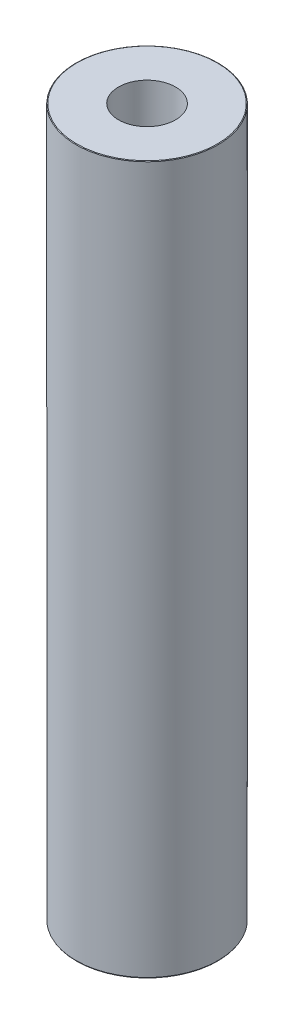
ISO-10303-21;
HEADER;
FILE_DESCRIPTION(('STEP AP214'),'2;1');
FILE_NAME('part.step','',(''),(''),'','','');
FILE_SCHEMA(('AUTOMOTIVE_DESIGN { 1 0 10303 214 1 1 1 1 }'));
ENDSEC;
DATA;
#1=APPLICATION_CONTEXT('core data for automotive mechanical design processes');
#2=APPLICATION_PROTOCOL_DEFINITION('international standard','automotive_design',2000,#1);
#3=PRODUCT_CONTEXT('',#1,'mechanical');
#4=PRODUCT('Part','Part','',(#3));
#5=PRODUCT_RELATED_PRODUCT_CATEGORY('part','',(#4));
#6=PRODUCT_DEFINITION_FORMATION('','',#4);
#7=PRODUCT_DEFINITION_CONTEXT('part definition',#1,'design');
#8=PRODUCT_DEFINITION('design','',#6,#7);
#9=PRODUCT_DEFINITION_SHAPE('','',#8);
#10=(LENGTH_UNIT() NAMED_UNIT(*) SI_UNIT(.MILLI.,.METRE.));
#11=(NAMED_UNIT(*) PLANE_ANGLE_UNIT() SI_UNIT($,.RADIAN.));
#12=(NAMED_UNIT(*) SI_UNIT($,.STERADIAN.) SOLID_ANGLE_UNIT());
#13=UNCERTAINTY_MEASURE_WITH_UNIT(LENGTH_MEASURE(1.E-05),#10,'distance_accuracy_value','');
#14=(GEOMETRIC_REPRESENTATION_CONTEXT(3) GLOBAL_UNCERTAINTY_ASSIGNED_CONTEXT((#13)) GLOBAL_UNIT_ASSIGNED_CONTEXT((#10,
#11,#12)) REPRESENTATION_CONTEXT('',''));
#15=CARTESIAN_POINT('',(0.,0.,0.));
#16=DIRECTION('',(0.,0.,1.));
#17=DIRECTION('',(1.,0.,0.));
#18=AXIS2_PLACEMENT_3D('',#15,#16,#17);
#19=CARTESIAN_POINT('',(0.,473.557068124802,0.));
#20=DIRECTION('',(0.,-1.,0.));
#21=DIRECTION('',(0.,0.,-1.));
#22=AXIS2_PLACEMENT_3D('',#19,#20,#21);
#23=CYLINDRICAL_SURFACE('',#22,47.5);
#24=CARTESIAN_POINT('',(0.,473.275420836199,0.));
#25=DIRECTION('',(0.,1.,0.));
#26=DIRECTION('',(0.,0.,1.));
#27=AXIS2_PLACEMENT_3D('',#24,#25,#26);
#28=CIRCLE('',#27,47.5);
#29=CARTESIAN_POINT('',(0.,473.275420836199,-47.5));
#30=VERTEX_POINT('',#29);
#31=EDGE_CURVE('E50',#30,#30,#28,.F.);
#32=CARTESIAN_POINT('',(0.,0.487827413674646,0.));
#33=DIRECTION('',(0.,1.,0.));
#34=DIRECTION('',(0.,0.,1.));
#35=AXIS2_PLACEMENT_3D('',#32,#33,#34);
#36=CIRCLE('',#35,47.5);
#37=CARTESIAN_POINT('',(0.,0.487827413674591,-47.5));
#38=VERTEX_POINT('',#37);
#39=EDGE_CURVE('E51',#38,#38,#36,.T.);
#40=CARTESIAN_POINT('',(0.,473.275420836199,-47.5));
#41=CARTESIAN_POINT('',(0.,468.350550071381,-47.5));
#42=CARTESIAN_POINT('',(0.,463.425679306563,-47.5));
#43=CARTESIAN_POINT('',(0.,453.575937776927,-47.5));
#44=CARTESIAN_POINT('',(0.,448.651067012109,-47.5));
#45=CARTESIAN_POINT('',(0.,438.801325482473,-47.5));
#46=CARTESIAN_POINT('',(0.,433.876454717655,-47.5));
#47=CARTESIAN_POINT('',(0.,424.026713188019,-47.5));
#48=CARTESIAN_POINT('',(0.,419.101842423202,-47.5));
#49=CARTESIAN_POINT('',(0.,409.252100893566,-47.5));
#50=CARTESIAN_POINT('',(0.,404.327230128748,-47.5));
#51=CARTESIAN_POINT('',(0.,394.477488599112,-47.5));
#52=CARTESIAN_POINT('',(0.,389.552617834294,-47.5));
#53=CARTESIAN_POINT('',(0.,379.702876304658,-47.5));
#54=CARTESIAN_POINT('',(0.,374.77800553984,-47.5));
#55=CARTESIAN_POINT('',(0.,364.928264010204,-47.5));
#56=CARTESIAN_POINT('',(0.,360.003393245386,-47.5));
#57=CARTESIAN_POINT('',(0.,350.15365171575,-47.5));
#58=CARTESIAN_POINT('',(0.,345.228780950932,-47.5));
#59=CARTESIAN_POINT('',(0.,335.379039421296,-47.5));
#60=CARTESIAN_POINT('',(0.,330.454168656478,-47.5));
#61=CARTESIAN_POINT('',(0.,320.604427126842,-47.5));
#62=CARTESIAN_POINT('',(0.,315.679556362024,-47.5));
#63=CARTESIAN_POINT('',(0.,305.829814832388,-47.5));
#64=CARTESIAN_POINT('',(0.,300.90494406757,-47.5));
#65=CARTESIAN_POINT('',(0.,291.055202537934,-47.5));
#66=CARTESIAN_POINT('',(0.,286.130331773117,-47.5));
#67=CARTESIAN_POINT('',(0.,276.280590243481,-47.5));
#68=CARTESIAN_POINT('',(0.,271.355719478663,-47.5));
#69=CARTESIAN_POINT('',(0.,261.505977949027,-47.5));
#70=CARTESIAN_POINT('',(0.,256.581107184209,-47.5));
#71=CARTESIAN_POINT('',(0.,246.731365654573,-47.5));
#72=CARTESIAN_POINT('',(0.,241.806494889755,-47.5));
#73=CARTESIAN_POINT('',(0.,231.956753360119,-47.5));
#74=CARTESIAN_POINT('',(0.,227.031882595301,-47.5));
#75=CARTESIAN_POINT('',(0.,217.182141065665,-47.5));
#76=CARTESIAN_POINT('',(0.,212.257270300847,-47.5));
#77=CARTESIAN_POINT('',(0.,202.407528771211,-47.5));
#78=CARTESIAN_POINT('',(0.,197.482658006393,-47.5));
#79=CARTESIAN_POINT('',(0.,187.632916476757,-47.5));
#80=CARTESIAN_POINT('',(0.,182.708045711939,-47.5));
#81=CARTESIAN_POINT('',(0.,172.858304182303,-47.5));
#82=CARTESIAN_POINT('',(0.,167.933433417485,-47.5));
#83=CARTESIAN_POINT('',(0.,158.083691887849,-47.5));
#84=CARTESIAN_POINT('',(0.,153.158821123031,-47.5));
#85=CARTESIAN_POINT('',(0.,143.309079593396,-47.5));
#86=CARTESIAN_POINT('',(0.,138.384208828578,-47.5));
#87=CARTESIAN_POINT('',(0.,128.534467298942,-47.5));
#88=CARTESIAN_POINT('',(0.,123.609596534124,-47.5));
#89=CARTESIAN_POINT('',(0.,113.759855004488,-47.5));
#90=CARTESIAN_POINT('',(0.,108.83498423967,-47.5));
#91=CARTESIAN_POINT('',(0.,98.9852427100338,-47.5));
#92=CARTESIAN_POINT('',(0.,94.0603719452159,-47.5));
#93=CARTESIAN_POINT('',(0.,84.21063041558,-47.5));
#94=CARTESIAN_POINT('',(0.,79.285759650762,-47.5));
#95=CARTESIAN_POINT('',(0.,69.4360181211261,-47.5));
#96=CARTESIAN_POINT('',(0.,64.5111473563081,-47.5));
#97=CARTESIAN_POINT('',(0.,54.6614058266722,-47.5));
#98=CARTESIAN_POINT('',(0.,49.7365350618542,-47.5));
#99=CARTESIAN_POINT('',(0.,39.8867935322182,-47.5));
#100=CARTESIAN_POINT('',(0.,34.9619227674003,-47.5));
#101=CARTESIAN_POINT('',(0.,25.1121812377644,-47.5));
#102=CARTESIAN_POINT('',(0.,20.1873104729464,-47.5));
#103=CARTESIAN_POINT('',(0.,10.3375689433105,-47.5));
#104=CARTESIAN_POINT('',(0.,5.41269817849254,-47.5));
#105=CARTESIAN_POINT('',(0.,0.487827413674591,-47.5));
#106=B_SPLINE_CURVE_WITH_KNOTS('',3,(#40,#41,#42,#43,#44,#45,#46,#47,#48,#49,#50,#51,#52,#53,
#54,#55,#56,#57,#58,#59,#60,#61,#62,#63,#64,#65,#66,#67,#68,#69,#70,#71,#72,#73,#74,#75,#76,#77,
#78,#79,#80,#81,#82,#83,#84,#85,#86,#87,#88,#89,#90,#91,#92,#93,#94,#95,#96,#97,#98,#99,#100,
#101,#102,#103,#104,#105),.UNSPECIFIED.,.F.,.F.,(4,2,2,2,2,2,2,2,2,2,2,2,2,2,2,2,2,2,2,2,2,2,2,
2,2,2,2,2,2,2,2,2,4),(0.,14.7746122944539,29.5492245889078,44.3238368833617,59.0984491778156,
73.8730614722695,88.6476737667234,103.422286061177,118.196898355631,132.971510650085,
147.746122944539,162.520735238993,177.295347533447,192.069959827901,206.844572122355,
221.619184416808,236.393796711262,251.168409005716,265.94302130017,280.717633594624,
295.492245889078,310.266858183532,325.041470477986,339.81608277244,354.590695066893,
369.365307361347,384.139919655801,398.914531950255,413.689144244709,428.463756539163,
443.238368833617,458.012981128071,472.787593422525),.UNSPECIFIED.);
#107=EDGE_CURVE('BSEAM39',#30,#38,#106,.T.);
#108=ORIENTED_EDGE('',*,*,#31,.T.);
#109=ORIENTED_EDGE('',*,*,#39,.T.);
#110=ORIENTED_EDGE('',*,*,#107,.T.);
#111=ORIENTED_EDGE('',*,*,#107,.F.);
#112=EDGE_LOOP('',(#108,#110,#109,#111));
#113=FACE_BOUND('',#112,.T.);
#114=ADVANCED_FACE('F39',(#113),#23,.T.);
#115=CARTESIAN_POINT('',(0.,473.557068124802,0.));
#116=DIRECTION('',(0.,1.,0.));
#117=DIRECTION('',(0.,0.,1.));
#118=AXIS2_PLACEMENT_3D('',#115,#116,#117);
#119=PLANE('',#118);
#120=CARTESIAN_POINT('',(0.,473.557068124802,0.));
#121=DIRECTION('',(0.,1.,0.));
#122=DIRECTION('',(0.,0.,1.));
#123=AXIS2_PLACEMENT_3D('',#120,#121,#122);
#124=CIRCLE('',#123,47.0121725863259);
#125=CARTESIAN_POINT('',(0.,473.557068124802,47.0121725863259));
#126=VERTEX_POINT('',#125);
#127=EDGE_CURVE('E54',#126,#126,#124,.T.);
#128=ORIENTED_EDGE('',*,*,#127,.T.);
#129=EDGE_LOOP('',(#128));
#130=FACE_BOUND('',#129,.T.);
#131=CARTESIAN_POINT('',(0.,473.557068124802,0.));
#132=DIRECTION('',(0.,1.,0.));
#133=DIRECTION('',(0.,0.,1.));
#134=AXIS2_PLACEMENT_3D('',#131,#132,#133);
#135=CIRCLE('',#134,19.0940090585276);
#136=CARTESIAN_POINT('',(0.,473.557068124802,-19.0940090585276));
#137=VERTEX_POINT('',#136);
#138=EDGE_CURVE('E58',#137,#137,#135,.T.);
#139=ORIENTED_EDGE('',*,*,#138,.F.);
#140=EDGE_LOOP('',(#139));
#141=FACE_BOUND('',#140,.T.);
#142=ADVANCED_FACE('F69',(#130,#141),#119,.T.);
#143=CARTESIAN_POINT('',(0.,0.,0.));
#144=DIRECTION('',(0.,1.,0.));
#145=DIRECTION('',(0.,0.,1.));
#146=AXIS2_PLACEMENT_3D('',#143,#144,#145);
#147=PLANE('',#146);
#148=CARTESIAN_POINT('',(0.,0.,0.));
#149=DIRECTION('',(0.,1.,0.));
#150=DIRECTION('',(0.,0.,1.));
#151=AXIS2_PLACEMENT_3D('',#148,#149,#150);
#152=CIRCLE('',#151,47.2183527113969);
#153=CARTESIAN_POINT('',(0.,0.,47.2183527113969));
#154=VERTEX_POINT('',#153);
#155=EDGE_CURVE('E10',#154,#154,#152,.F.);
#156=ORIENTED_EDGE('',*,*,#155,.T.);
#157=EDGE_LOOP('',(#156));
#158=FACE_BOUND('',#157,.T.);
#159=CARTESIAN_POINT('',(0.,0.,0.));
#160=DIRECTION('',(0.,1.,0.));
#161=DIRECTION('',(0.,0.,1.));
#162=AXIS2_PLACEMENT_3D('',#159,#160,#161);
#163=CIRCLE('',#162,19.0940090585276);
#164=CARTESIAN_POINT('',(0.,0.,-19.0940090585276));
#165=VERTEX_POINT('',#164);
#166=EDGE_CURVE('E63',#165,#165,#163,.T.);
#167=ORIENTED_EDGE('',*,*,#166,.T.);
#168=EDGE_LOOP('',(#167));
#169=FACE_BOUND('',#168,.T.);
#170=ADVANCED_FACE('F75',(#158,#169),#147,.F.);
#171=CARTESIAN_POINT('',(0.,473.557068124802,0.));
#172=DIRECTION('',(0.,-1.,0.));
#173=DIRECTION('',(0.,0.,-1.));
#174=AXIS2_PLACEMENT_3D('',#171,#172,#173);
#175=CYLINDRICAL_SURFACE('',#174,19.0940090585276);
#176=CARTESIAN_POINT('',(0.,473.557068124802,-19.0940090585276));
#177=CARTESIAN_POINT('',(0.,468.624181998502,-19.0940090585276));
#178=CARTESIAN_POINT('',(0.,463.691295872202,-19.0940090585276));
#179=CARTESIAN_POINT('',(0.,453.825523619602,-19.0940090585276));
#180=CARTESIAN_POINT('',(0.,448.892637493302,-19.0940090585276));
#181=CARTESIAN_POINT('',(0.,439.026865240702,-19.0940090585276));
#182=CARTESIAN_POINT('',(0.,434.093979114402,-19.0940090585276));
#183=CARTESIAN_POINT('',(0.,424.228206861802,-19.0940090585276));
#184=CARTESIAN_POINT('',(0.,419.295320735502,-19.0940090585276));
#185=CARTESIAN_POINT('',(0.,409.429548482902,-19.0940090585276));
#186=CARTESIAN_POINT('',(0.,404.496662356602,-19.0940090585276));
#187=CARTESIAN_POINT('',(0.,394.630890104002,-19.0940090585276));
#188=CARTESIAN_POINT('',(0.,389.698003977702,-19.0940090585276));
#189=CARTESIAN_POINT('',(0.,379.832231725102,-19.0940090585276));
#190=CARTESIAN_POINT('',(0.,374.899345598802,-19.0940090585276));
#191=CARTESIAN_POINT('',(0.,365.033573346202,-19.0940090585276));
#192=CARTESIAN_POINT('',(0.,360.100687219901,-19.0940090585276));
#193=CARTESIAN_POINT('',(0.,350.234914967301,-19.0940090585276));
#194=CARTESIAN_POINT('',(0.,345.302028841001,-19.0940090585276));
#195=CARTESIAN_POINT('',(0.,335.436256588401,-19.0940090585276));
#196=CARTESIAN_POINT('',(0.,330.503370462101,-19.0940090585276));
#197=CARTESIAN_POINT('',(0.,320.637598209501,-19.0940090585276));
#198=CARTESIAN_POINT('',(0.,315.704712083201,-19.0940090585276));
#199=CARTESIAN_POINT('',(0.,305.838939830601,-19.0940090585276));
#200=CARTESIAN_POINT('',(0.,300.906053704301,-19.0940090585276));
#201=CARTESIAN_POINT('',(0.,291.040281451701,-19.0940090585276));
#202=CARTESIAN_POINT('',(0.,286.107395325401,-19.0940090585276));
#203=CARTESIAN_POINT('',(0.,276.241623072801,-19.0940090585276));
#204=CARTESIAN_POINT('',(0.,271.308736946501,-19.0940090585276));
#205=CARTESIAN_POINT('',(0.,261.442964693901,-19.0940090585276));
#206=CARTESIAN_POINT('',(0.,256.510078567601,-19.0940090585276));
#207=CARTESIAN_POINT('',(0.,246.644306315001,-19.0940090585276));
#208=CARTESIAN_POINT('',(0.,241.711420188701,-19.0940090585276));
#209=CARTESIAN_POINT('',(0.,231.845647936101,-19.0940090585276));
#210=CARTESIAN_POINT('',(0.,226.912761809801,-19.0940090585276));
#211=CARTESIAN_POINT('',(0.,217.046989557201,-19.0940090585276));
#212=CARTESIAN_POINT('',(0.,212.114103430901,-19.0940090585276));
#213=CARTESIAN_POINT('',(0.,202.248331178301,-19.0940090585276));
#214=CARTESIAN_POINT('',(0.,197.315445052001,-19.0940090585276));
#215=CARTESIAN_POINT('',(0.,187.449672799401,-19.0940090585276));
#216=CARTESIAN_POINT('',(0.,182.516786673101,-19.0940090585276));
#217=CARTESIAN_POINT('',(0.,172.651014420501,-19.0940090585276));
#218=CARTESIAN_POINT('',(0.,167.718128294201,-19.0940090585276));
#219=CARTESIAN_POINT('',(0.,157.852356041601,-19.0940090585276));
#220=CARTESIAN_POINT('',(0.,152.919469915301,-19.0940090585276));
#221=CARTESIAN_POINT('',(0.,143.053697662701,-19.0940090585276));
#222=CARTESIAN_POINT('',(0.,138.120811536401,-19.0940090585276));
#223=CARTESIAN_POINT('',(0.,128.255039283801,-19.0940090585276));
#224=CARTESIAN_POINT('',(0.,123.322153157501,-19.0940090585276));
#225=CARTESIAN_POINT('',(0.,113.4563809049,-19.0940090585276));
#226=CARTESIAN_POINT('',(0.,108.5234947786,-19.0940090585276));
#227=CARTESIAN_POINT('',(0.,98.6577225260004,-19.0940090585276));
#228=CARTESIAN_POINT('',(0.,93.7248363997004,-19.0940090585276));
#229=CARTESIAN_POINT('',(0.,83.8590641471004,-19.0940090585276));
#230=CARTESIAN_POINT('',(0.,78.9261780208003,-19.0940090585276));
#231=CARTESIAN_POINT('',(0.,69.0604057682003,-19.0940090585276));
#232=CARTESIAN_POINT('',(0.,64.1275196419003,-19.0940090585276));
#233=CARTESIAN_POINT('',(0.,54.2617473893002,-19.0940090585276));
#234=CARTESIAN_POINT('',(0.,49.3288612630002,-19.0940090585276));
#235=CARTESIAN_POINT('',(0.,39.4630890104002,-19.0940090585276));
#236=CARTESIAN_POINT('',(0.,34.5302028841001,-19.0940090585276));
#237=CARTESIAN_POINT('',(0.,24.6644306315001,-19.0940090585276));
#238=CARTESIAN_POINT('',(0.,19.7315445052001,-19.0940090585276));
#239=CARTESIAN_POINT('',(0.,9.86577225260003,-19.0940090585276));
#240=CARTESIAN_POINT('',(0.,4.93288612630001,-19.0940090585276));
#241=CARTESIAN_POINT('',(0.,0.,-19.0940090585276));
#242=B_SPLINE_CURVE_WITH_KNOTS('',3,(#176,#177,#178,#179,#180,#181,#182,#183,#184,#185,#186,
#187,#188,#189,#190,#191,#192,#193,#194,#195,#196,#197,#198,#199,#200,#201,#202,#203,#204,#205,
#206,#207,#208,#209,#210,#211,#212,#213,#214,#215,#216,#217,#218,#219,#220,#221,#222,#223,#224,
#225,#226,#227,#228,#229,#230,#231,#232,#233,#234,#235,#236,#237,#238,#239,#240,#241),
.UNSPECIFIED.,.F.,.F.,(4,2,2,2,2,2,2,2,2,2,2,2,2,2,2,2,2,2,2,2,2,2,2,2,2,2,2,2,2,2,2,2,4),(0.,
14.7986583789001,29.5973167578001,44.3959751367002,59.1946335156003,73.9932918945003,
88.7919502734004,103.5906086523,118.389267031201,133.187925410101,147.986583789001,
162.785242167901,177.583900546801,192.382558925701,207.181217304601,221.979875683501,
236.778534062401,251.577192441301,266.375850820201,281.174509199101,295.973167578001,
310.771825956901,325.570484335801,340.369142714701,355.167801093601,369.966459472502,
384.765117851402,399.563776230302,414.362434609202,429.161092988102,443.959751367002,
458.758409745902,473.557068124802),.UNSPECIFIED.);
#243=EDGE_CURVE('BSEAM70',#137,#165,#242,.T.);
#244=ORIENTED_EDGE('',*,*,#138,.T.);
#245=ORIENTED_EDGE('',*,*,#166,.F.);
#246=ORIENTED_EDGE('',*,*,#243,.T.);
#247=ORIENTED_EDGE('',*,*,#243,.F.);
#248=EDGE_LOOP('',(#244,#246,#245,#247));
#249=FACE_BOUND('',#248,.T.);
#250=ADVANCED_FACE('F70',(#249),#175,.F.);
#251=CARTESIAN_POINT('',(0.,473.557068124802,0.));
#252=DIRECTION('',(0.,-1.,0.));
#253=DIRECTION('',(0.,0.,-1.));
#254=AXIS2_PLACEMENT_3D('',#251,#252,#253);
#255=CONICAL_SURFACE('',#254,47.0121725863259,1.04719755119659);
#256=ORIENTED_EDGE('',*,*,#31,.F.);
#257=EDGE_LOOP('',(#256));
#258=FACE_BOUND('',#257,.T.);
#259=ORIENTED_EDGE('',*,*,#127,.F.);
#260=EDGE_LOOP('',(#259));
#261=FACE_BOUND('',#260,.T.);
#262=ADVANCED_FACE('F81',(#258,#261),#255,.T.);
#263=CARTESIAN_POINT('',(0.,0.487827413674646,0.));
#264=DIRECTION('',(0.,1.,0.));
#265=DIRECTION('',(0.,0.,1.));
#266=AXIS2_PLACEMENT_3D('',#263,#264,#265);
#267=CONICAL_SURFACE('',#266,47.5,0.523598775598312);
#268=ORIENTED_EDGE('',*,*,#155,.F.);
#269=EDGE_LOOP('',(#268));
#270=FACE_BOUND('',#269,.T.);
#271=ORIENTED_EDGE('',*,*,#39,.F.);
#272=EDGE_LOOP('',(#271));
#273=FACE_BOUND('',#272,.T.);
#274=ADVANCED_FACE('F45',(#270,#273),#267,.T.);
#275=CLOSED_SHELL('',(#114,#142,#170,#250,#262,#274));
#276=MANIFOLD_SOLID_BREP('B2',#275);
#277=ADVANCED_BREP_SHAPE_REPRESENTATION('',(#18,#276),#14);
#278=SHAPE_DEFINITION_REPRESENTATION(#9,#277);
ENDSEC;
END-ISO-10303-21;
